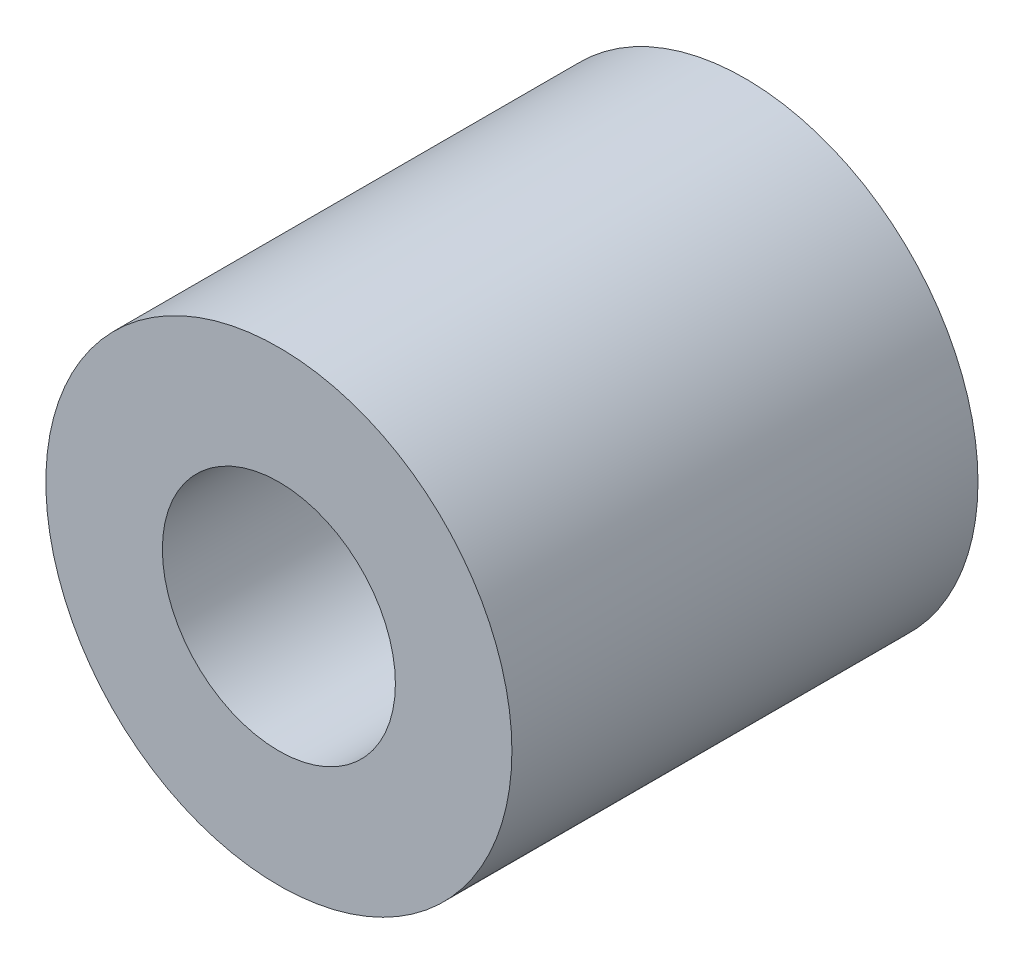
ISO-10303-21;
HEADER;
FILE_DESCRIPTION(('STEP AP214'),'2;1');
FILE_NAME('part.step','',(''),(''),'','','');
FILE_SCHEMA(('AUTOMOTIVE_DESIGN { 1 0 10303 214 1 1 1 1 }'));
ENDSEC;
DATA;
#1=APPLICATION_CONTEXT('core data for automotive mechanical design processes');
#2=APPLICATION_PROTOCOL_DEFINITION('international standard','automotive_design',2000,#1);
#3=PRODUCT_CONTEXT('',#1,'mechanical');
#4=PRODUCT('Part','Part','',(#3));
#5=PRODUCT_RELATED_PRODUCT_CATEGORY('part','',(#4));
#6=PRODUCT_DEFINITION_FORMATION('','',#4);
#7=PRODUCT_DEFINITION_CONTEXT('part definition',#1,'design');
#8=PRODUCT_DEFINITION('design','',#6,#7);
#9=PRODUCT_DEFINITION_SHAPE('','',#8);
#10=(LENGTH_UNIT() NAMED_UNIT(*) SI_UNIT(.MILLI.,.METRE.));
#11=(NAMED_UNIT(*) PLANE_ANGLE_UNIT() SI_UNIT($,.RADIAN.));
#12=(NAMED_UNIT(*) SI_UNIT($,.STERADIAN.) SOLID_ANGLE_UNIT());
#13=UNCERTAINTY_MEASURE_WITH_UNIT(LENGTH_MEASURE(1.E-05),#10,'distance_accuracy_value','');
#14=(GEOMETRIC_REPRESENTATION_CONTEXT(3) GLOBAL_UNCERTAINTY_ASSIGNED_CONTEXT((#13)) GLOBAL_UNIT_ASSIGNED_CONTEXT((#10,
#11,#12)) REPRESENTATION_CONTEXT('',''));
#15=CARTESIAN_POINT('',(0.,0.,0.));
#16=DIRECTION('',(0.,0.,1.));
#17=DIRECTION('',(1.,0.,0.));
#18=AXIS2_PLACEMENT_3D('',#15,#16,#17);
#19=CARTESIAN_POINT('',(0.,0.,8.));
#20=DIRECTION('',(0.,0.,-1.));
#21=DIRECTION('',(-1.,0.,0.));
#22=AXIS2_PLACEMENT_3D('',#19,#20,#21);
#23=CYLINDRICAL_SURFACE('',#22,4.);
#24=CARTESIAN_POINT('',(0.,0.,8.));
#25=DIRECTION('',(0.,0.,1.));
#26=DIRECTION('',(1.,0.,0.));
#27=AXIS2_PLACEMENT_3D('',#24,#25,#26);
#28=CIRCLE('',#27,4.);
#29=CARTESIAN_POINT('',(4.,0.,8.));
#30=VERTEX_POINT('',#29);
#31=EDGE_CURVE('E10',#30,#30,#28,.T.);
#32=ORIENTED_EDGE('',*,*,#31,.F.);
#33=EDGE_LOOP('',(#32));
#34=FACE_BOUND('',#33,.T.);
#35=CARTESIAN_POINT('',(0.,0.,0.));
#36=DIRECTION('',(0.,0.,1.));
#37=DIRECTION('',(1.,0.,0.));
#38=AXIS2_PLACEMENT_3D('',#35,#36,#37);
#39=CIRCLE('',#38,4.);
#40=CARTESIAN_POINT('',(4.,0.,0.));
#41=VERTEX_POINT('',#40);
#42=EDGE_CURVE('E39',#41,#41,#39,.T.);
#43=ORIENTED_EDGE('',*,*,#42,.T.);
#44=EDGE_LOOP('',(#43));
#45=FACE_BOUND('',#44,.T.);
#46=ADVANCED_FACE('F32',(#34,#45),#23,.T.);
#47=CARTESIAN_POINT('',(0.,0.,8.));
#48=DIRECTION('',(0.,0.,1.));
#49=DIRECTION('',(1.,0.,0.));
#50=AXIS2_PLACEMENT_3D('',#47,#48,#49);
#51=PLANE('',#50);
#52=CARTESIAN_POINT('',(0.,0.,8.));
#53=DIRECTION('',(0.,0.,1.));
#54=DIRECTION('',(1.,0.,0.));
#55=AXIS2_PLACEMENT_3D('',#52,#53,#54);
#56=CIRCLE('',#55,2.);
#57=CARTESIAN_POINT('',(2.,0.,8.));
#58=VERTEX_POINT('',#57);
#59=EDGE_CURVE('E45',#58,#58,#56,.T.);
#60=ORIENTED_EDGE('',*,*,#59,.F.);
#61=EDGE_LOOP('',(#60));
#62=FACE_BOUND('',#61,.T.);
#63=ORIENTED_EDGE('',*,*,#31,.T.);
#64=EDGE_LOOP('',(#63));
#65=FACE_BOUND('',#64,.T.);
#66=ADVANCED_FACE('F61',(#62,#65),#51,.T.);
#67=CARTESIAN_POINT('',(0.,0.,0.));
#68=DIRECTION('',(0.,0.,1.));
#69=DIRECTION('',(1.,0.,0.));
#70=AXIS2_PLACEMENT_3D('',#67,#68,#69);
#71=PLANE('',#70);
#72=CARTESIAN_POINT('',(0.,0.,0.));
#73=DIRECTION('',(0.,0.,1.));
#74=DIRECTION('',(1.,0.,0.));
#75=AXIS2_PLACEMENT_3D('',#72,#73,#74);
#76=CIRCLE('',#75,2.);
#77=CARTESIAN_POINT('',(2.,0.,0.));
#78=VERTEX_POINT('',#77);
#79=EDGE_CURVE('E35',#78,#78,#76,.T.);
#80=ORIENTED_EDGE('',*,*,#79,.T.);
#81=EDGE_LOOP('',(#80));
#82=FACE_BOUND('',#81,.T.);
#83=ORIENTED_EDGE('',*,*,#42,.F.);
#84=EDGE_LOOP('',(#83));
#85=FACE_BOUND('',#84,.T.);
#86=ADVANCED_FACE('F52',(#82,#85),#71,.F.);
#87=CARTESIAN_POINT('',(0.,0.,-7.));
#88=DIRECTION('',(0.,0.,1.));
#89=DIRECTION('',(1.,0.,0.));
#90=AXIS2_PLACEMENT_3D('',#87,#88,#89);
#91=CYLINDRICAL_SURFACE('',#90,2.);
#92=ORIENTED_EDGE('',*,*,#59,.T.);
#93=EDGE_LOOP('',(#92));
#94=FACE_BOUND('',#93,.T.);
#95=ORIENTED_EDGE('',*,*,#79,.F.);
#96=EDGE_LOOP('',(#95));
#97=FACE_BOUND('',#96,.T.);
#98=ADVANCED_FACE('F55',(#94,#97),#91,.F.);
#99=CLOSED_SHELL('',(#46,#66,#86,#98));
#100=MANIFOLD_SOLID_BREP('B2',#99);
#101=ADVANCED_BREP_SHAPE_REPRESENTATION('',(#18,#100),#14);
#102=SHAPE_DEFINITION_REPRESENTATION(#9,#101);
ENDSEC;
END-ISO-10303-21;
